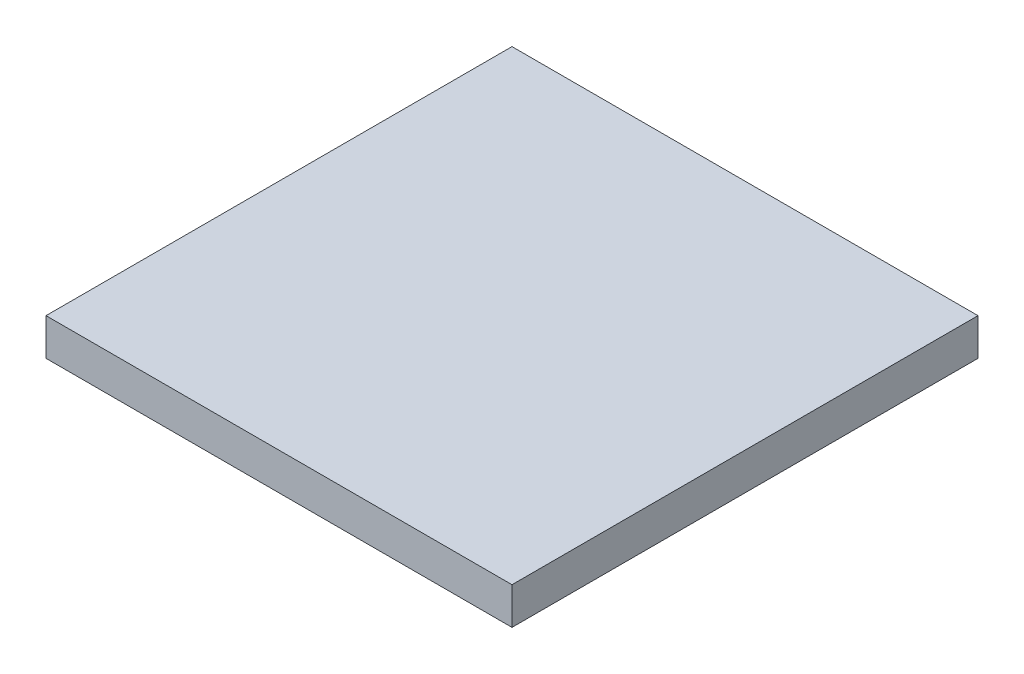
ISO-10303-21;
HEADER;
FILE_DESCRIPTION(('STEP AP214'),'2;1');
FILE_NAME('part.step','',(''),(''),'','','');
FILE_SCHEMA(('AUTOMOTIVE_DESIGN { 1 0 10303 214 1 1 1 1 }'));
ENDSEC;
DATA;
#1=APPLICATION_CONTEXT('core data for automotive mechanical design processes');
#2=APPLICATION_PROTOCOL_DEFINITION('international standard','automotive_design',2000,#1);
#3=PRODUCT_CONTEXT('',#1,'mechanical');
#4=PRODUCT('Part','Part','',(#3));
#5=PRODUCT_RELATED_PRODUCT_CATEGORY('part','',(#4));
#6=PRODUCT_DEFINITION_FORMATION('','',#4);
#7=PRODUCT_DEFINITION_CONTEXT('part definition',#1,'design');
#8=PRODUCT_DEFINITION('design','',#6,#7);
#9=PRODUCT_DEFINITION_SHAPE('','',#8);
#10=(LENGTH_UNIT() NAMED_UNIT(*) SI_UNIT(.MILLI.,.METRE.));
#11=(NAMED_UNIT(*) PLANE_ANGLE_UNIT() SI_UNIT($,.RADIAN.));
#12=(NAMED_UNIT(*) SI_UNIT($,.STERADIAN.) SOLID_ANGLE_UNIT());
#13=UNCERTAINTY_MEASURE_WITH_UNIT(LENGTH_MEASURE(1.E-05),#10,'distance_accuracy_value','');
#14=(GEOMETRIC_REPRESENTATION_CONTEXT(3) GLOBAL_UNCERTAINTY_ASSIGNED_CONTEXT((#13)) GLOBAL_UNIT_ASSIGNED_CONTEXT((#10,
#11,#12)) REPRESENTATION_CONTEXT('',''));
#15=CARTESIAN_POINT('',(0.,0.,0.));
#16=DIRECTION('',(0.,0.,1.));
#17=DIRECTION('',(1.,0.,0.));
#18=AXIS2_PLACEMENT_3D('',#15,#16,#17);
#19=CARTESIAN_POINT('',(-50.0895263536971,3.175,5.1654712206218));
#20=DIRECTION('',(1.,0.,0.));
#21=DIRECTION('',(0.,0.,-1.));
#22=AXIS2_PLACEMENT_3D('',#19,#20,#21);
#23=PLANE('',#22);
#24=DIRECTION('',(0.,0.,1.));
#25=VECTOR('',#24,1.);
#26=CARTESIAN_POINT('',(-50.0895263536971,0.,5.1654712206218));
#27=LINE('',#26,#25);
#28=CARTESIAN_POINT('',(-50.0895263536971,0.,5.1654712206218));
#29=VERTEX_POINT('',#28);
#30=CARTESIAN_POINT('',(-50.0895263536971,0.,45.1654712206218));
#31=VERTEX_POINT('',#30);
#32=EDGE_CURVE('E95',#29,#31,#27,.T.);
#33=ORIENTED_EDGE('',*,*,#32,.T.);
#34=DIRECTION('',(0.,-1.,0.));
#35=VECTOR('',#34,1.);
#36=CARTESIAN_POINT('',(-50.0895263536971,3.175,45.1654712206218));
#37=LINE('',#36,#35);
#38=CARTESIAN_POINT('',(-50.0895263536971,3.175,45.1654712206218));
#39=VERTEX_POINT('',#38);
#40=EDGE_CURVE('E11',#39,#31,#37,.T.);
#41=ORIENTED_EDGE('',*,*,#40,.F.);
#42=DIRECTION('',(0.,0.,1.));
#43=VECTOR('',#42,1.);
#44=CARTESIAN_POINT('',(-50.0895263536971,3.175,5.1654712206218));
#45=LINE('',#44,#43);
#46=CARTESIAN_POINT('',(-50.0895263536971,3.175,5.1654712206218));
#47=VERTEX_POINT('',#46);
#48=EDGE_CURVE('E83',#47,#39,#45,.T.);
#49=ORIENTED_EDGE('',*,*,#48,.F.);
#50=DIRECTION('',(0.,-1.,0.));
#51=VECTOR('',#50,1.);
#52=CARTESIAN_POINT('',(-50.0895263536971,3.175,5.1654712206218));
#53=LINE('',#52,#51);
#54=EDGE_CURVE('E91',#47,#29,#53,.T.);
#55=ORIENTED_EDGE('',*,*,#54,.T.);
#56=EDGE_LOOP('',(#33,#41,#49,#55));
#57=FACE_BOUND('',#56,.T.);
#58=ADVANCED_FACE('F32',(#57),#23,.F.);
#59=CARTESIAN_POINT('',(-50.0895263536971,3.175,45.1654712206218));
#60=DIRECTION('',(0.,0.,-1.));
#61=DIRECTION('',(-1.,0.,0.));
#62=AXIS2_PLACEMENT_3D('',#59,#60,#61);
#63=PLANE('',#62);
#64=DIRECTION('',(1.,0.,0.));
#65=VECTOR('',#64,1.);
#66=CARTESIAN_POINT('',(-50.0895263536971,0.,45.1654712206218));
#67=LINE('',#66,#65);
#68=CARTESIAN_POINT('',(-10.0895263536971,0.,45.1654712206218));
#69=VERTEX_POINT('',#68);
#70=EDGE_CURVE('E87',#31,#69,#67,.T.);
#71=ORIENTED_EDGE('',*,*,#70,.T.);
#72=DIRECTION('',(0.,-1.,0.));
#73=VECTOR('',#72,1.);
#74=CARTESIAN_POINT('',(-10.0895263536971,3.175,45.1654712206218));
#75=LINE('',#74,#73);
#76=CARTESIAN_POINT('',(-10.0895263536971,3.175,45.1654712206218));
#77=VERTEX_POINT('',#76);
#78=EDGE_CURVE('E40',#77,#69,#75,.T.);
#79=ORIENTED_EDGE('',*,*,#78,.F.);
#80=DIRECTION('',(1.,0.,0.));
#81=VECTOR('',#80,1.);
#82=CARTESIAN_POINT('',(-50.0895263536971,3.175,45.1654712206218));
#83=LINE('',#82,#81);
#84=EDGE_CURVE('E78',#39,#77,#83,.T.);
#85=ORIENTED_EDGE('',*,*,#84,.F.);
#86=ORIENTED_EDGE('',*,*,#40,.T.);
#87=EDGE_LOOP('',(#71,#79,#85,#86));
#88=FACE_BOUND('',#87,.T.);
#89=ADVANCED_FACE('F86',(#88),#63,.F.);
#90=CARTESIAN_POINT('',(-10.0895263536971,3.175,5.1654712206218));
#91=DIRECTION('',(-1.,0.,0.));
#92=DIRECTION('',(0.,0.,1.));
#93=AXIS2_PLACEMENT_3D('',#90,#91,#92);
#94=PLANE('',#93);
#95=DIRECTION('',(0.,0.,-1.));
#96=VECTOR('',#95,1.);
#97=CARTESIAN_POINT('',(-10.0895263536971,0.,5.1654712206218));
#98=LINE('',#97,#96);
#99=CARTESIAN_POINT('',(-10.0895263536971,0.,5.1654712206218));
#100=VERTEX_POINT('',#99);
#101=EDGE_CURVE('E65',#69,#100,#98,.T.);
#102=ORIENTED_EDGE('',*,*,#101,.T.);
#103=DIRECTION('',(0.,-1.,0.));
#104=VECTOR('',#103,1.);
#105=CARTESIAN_POINT('',(-10.0895263536971,3.175,5.1654712206218));
#106=LINE('',#105,#104);
#107=CARTESIAN_POINT('',(-10.0895263536971,3.175,5.1654712206218));
#108=VERTEX_POINT('',#107);
#109=EDGE_CURVE('E88',#108,#100,#106,.T.);
#110=ORIENTED_EDGE('',*,*,#109,.F.);
#111=DIRECTION('',(0.,0.,-1.));
#112=VECTOR('',#111,1.);
#113=CARTESIAN_POINT('',(-10.0895263536971,3.175,5.1654712206218));
#114=LINE('',#113,#112);
#115=EDGE_CURVE('E81',#77,#108,#114,.T.);
#116=ORIENTED_EDGE('',*,*,#115,.F.);
#117=ORIENTED_EDGE('',*,*,#78,.T.);
#118=EDGE_LOOP('',(#102,#110,#116,#117));
#119=FACE_BOUND('',#118,.T.);
#120=ADVANCED_FACE('F89',(#119),#94,.F.);
#121=CARTESIAN_POINT('',(-50.0895263536971,3.175,5.1654712206218));
#122=DIRECTION('',(0.,0.,1.));
#123=DIRECTION('',(1.,0.,0.));
#124=AXIS2_PLACEMENT_3D('',#121,#122,#123);
#125=PLANE('',#124);
#126=DIRECTION('',(-1.,0.,0.));
#127=VECTOR('',#126,1.);
#128=CARTESIAN_POINT('',(-50.0895263536971,0.,5.1654712206218));
#129=LINE('',#128,#127);
#130=EDGE_CURVE('E71',#100,#29,#129,.T.);
#131=ORIENTED_EDGE('',*,*,#130,.T.);
#132=ORIENTED_EDGE('',*,*,#54,.F.);
#133=DIRECTION('',(-1.,0.,0.));
#134=VECTOR('',#133,1.);
#135=CARTESIAN_POINT('',(-50.0895263536971,3.175,5.1654712206218));
#136=LINE('',#135,#134);
#137=EDGE_CURVE('E48',#108,#47,#136,.T.);
#138=ORIENTED_EDGE('',*,*,#137,.F.);
#139=ORIENTED_EDGE('',*,*,#109,.T.);
#140=EDGE_LOOP('',(#131,#132,#138,#139));
#141=FACE_BOUND('',#140,.T.);
#142=ADVANCED_FACE('F102',(#141),#125,.F.);
#143=CARTESIAN_POINT('',(-50.0895263536971,3.175,45.1654712206218));
#144=DIRECTION('',(0.,1.,0.));
#145=DIRECTION('',(0.,0.,1.));
#146=AXIS2_PLACEMENT_3D('',#143,#144,#145);
#147=PLANE('',#146);
#148=ORIENTED_EDGE('',*,*,#48,.T.);
#149=ORIENTED_EDGE('',*,*,#84,.T.);
#150=ORIENTED_EDGE('',*,*,#115,.T.);
#151=ORIENTED_EDGE('',*,*,#137,.T.);
#152=EDGE_LOOP('',(#148,#149,#150,#151));
#153=FACE_BOUND('',#152,.T.);
#154=ADVANCED_FACE('F79',(#153),#147,.T.);
#155=CARTESIAN_POINT('',(-50.0895263536971,0.,45.1654712206218));
#156=DIRECTION('',(0.,1.,0.));
#157=DIRECTION('',(0.,0.,1.));
#158=AXIS2_PLACEMENT_3D('',#155,#156,#157);
#159=PLANE('',#158);
#160=ORIENTED_EDGE('',*,*,#32,.F.);
#161=ORIENTED_EDGE('',*,*,#130,.F.);
#162=ORIENTED_EDGE('',*,*,#101,.F.);
#163=ORIENTED_EDGE('',*,*,#70,.F.);
#164=EDGE_LOOP('',(#160,#161,#162,#163));
#165=FACE_BOUND('',#164,.T.);
#166=ADVANCED_FACE('F105',(#165),#159,.F.);
#167=CLOSED_SHELL('',(#58,#89,#120,#142,#154,#166));
#168=MANIFOLD_SOLID_BREP('B2',#167);
#169=ADVANCED_BREP_SHAPE_REPRESENTATION('',(#18,#168),#14);
#170=SHAPE_DEFINITION_REPRESENTATION(#9,#169);
ENDSEC;
END-ISO-10303-21;
